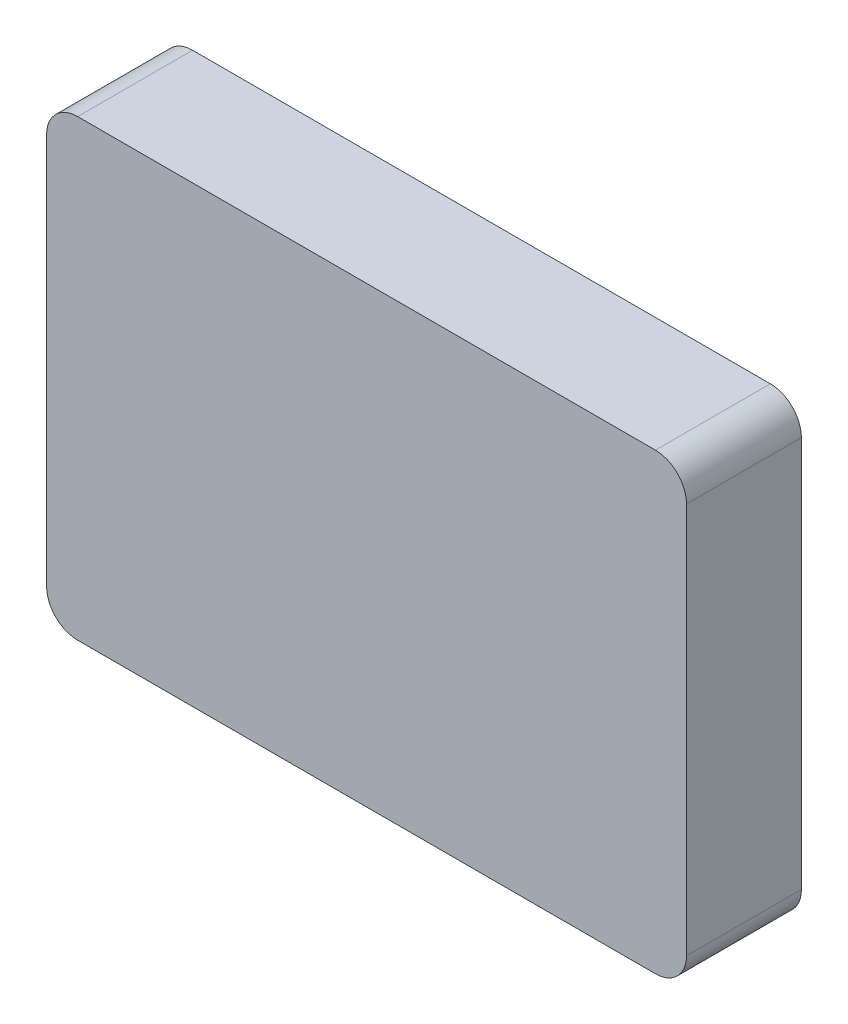
ISO-10303-21;
HEADER;
FILE_DESCRIPTION(('STEP AP214'),'2;1');
FILE_NAME('part.step','',(''),(''),'','','');
FILE_SCHEMA(('AUTOMOTIVE_DESIGN { 1 0 10303 214 1 1 1 1 }'));
ENDSEC;
DATA;
#1=APPLICATION_CONTEXT('core data for automotive mechanical design processes');
#2=APPLICATION_PROTOCOL_DEFINITION('international standard','automotive_design',2000,#1);
#3=PRODUCT_CONTEXT('',#1,'mechanical');
#4=PRODUCT('Part','Part','',(#3));
#5=PRODUCT_RELATED_PRODUCT_CATEGORY('part','',(#4));
#6=PRODUCT_DEFINITION_FORMATION('','',#4);
#7=PRODUCT_DEFINITION_CONTEXT('part definition',#1,'design');
#8=PRODUCT_DEFINITION('design','',#6,#7);
#9=PRODUCT_DEFINITION_SHAPE('','',#8);
#10=(LENGTH_UNIT() NAMED_UNIT(*) SI_UNIT(.MILLI.,.METRE.));
#11=(NAMED_UNIT(*) PLANE_ANGLE_UNIT() SI_UNIT($,.RADIAN.));
#12=(NAMED_UNIT(*) SI_UNIT($,.STERADIAN.) SOLID_ANGLE_UNIT());
#13=UNCERTAINTY_MEASURE_WITH_UNIT(LENGTH_MEASURE(1.E-05),#10,'distance_accuracy_value','');
#14=(GEOMETRIC_REPRESENTATION_CONTEXT(3) GLOBAL_UNCERTAINTY_ASSIGNED_CONTEXT((#13)) GLOBAL_UNIT_ASSIGNED_CONTEXT((#10,
#11,#12)) REPRESENTATION_CONTEXT('',''));
#15=CARTESIAN_POINT('',(0.,0.,0.));
#16=DIRECTION('',(0.,0.,1.));
#17=DIRECTION('',(1.,0.,0.));
#18=AXIS2_PLACEMENT_3D('',#15,#16,#17);
#19=CARTESIAN_POINT('',(0.,0.,-18.5));
#20=DIRECTION('',(0.,0.,-1.));
#21=DIRECTION('',(-1.,0.,0.));
#22=AXIS2_PLACEMENT_3D('',#19,#20,#21);
#23=PLANE('',#22);
#24=DIRECTION('',(1.,0.,0.));
#25=VECTOR('',#24,1.);
#26=CARTESIAN_POINT('',(-51.5,-36.5,-18.5));
#27=LINE('',#26,#25);
#28=CARTESIAN_POINT('',(-46.5,-36.5,-18.5));
#29=VERTEX_POINT('',#28);
#30=CARTESIAN_POINT('',(46.5,-36.5,-18.5));
#31=VERTEX_POINT('',#30);
#32=EDGE_CURVE('E178',#29,#31,#27,.T.);
#33=ORIENTED_EDGE('',*,*,#32,.F.);
#34=CARTESIAN_POINT('',(-46.5,-31.5,-18.5));
#35=DIRECTION('',(0.,0.,-1.));
#36=DIRECTION('',(-1.,0.,0.));
#37=AXIS2_PLACEMENT_3D('',#34,#35,#36);
#38=CIRCLE('',#37,5.);
#39=CARTESIAN_POINT('',(-51.5,-31.5,-18.5));
#40=VERTEX_POINT('',#39);
#41=EDGE_CURVE('E214',#29,#40,#38,.T.);
#42=ORIENTED_EDGE('',*,*,#41,.T.);
#43=DIRECTION('',(0.,-1.,0.));
#44=VECTOR('',#43,1.);
#45=CARTESIAN_POINT('',(-51.5,-36.5,-18.5));
#46=LINE('',#45,#44);
#47=CARTESIAN_POINT('',(-51.5,31.5,-18.5));
#48=VERTEX_POINT('',#47);
#49=EDGE_CURVE('E175',#48,#40,#46,.T.);
#50=ORIENTED_EDGE('',*,*,#49,.F.);
#51=CARTESIAN_POINT('',(-46.5,31.5,-18.5));
#52=DIRECTION('',(0.,0.,-1.));
#53=DIRECTION('',(-1.,0.,0.));
#54=AXIS2_PLACEMENT_3D('',#51,#52,#53);
#55=CIRCLE('',#54,5.);
#56=CARTESIAN_POINT('',(-46.5,36.5,-18.5));
#57=VERTEX_POINT('',#56);
#58=EDGE_CURVE('E51',#48,#57,#55,.T.);
#59=ORIENTED_EDGE('',*,*,#58,.T.);
#60=DIRECTION('',(-1.,0.,0.));
#61=VECTOR('',#60,1.);
#62=CARTESIAN_POINT('',(38.,36.5,-18.5));
#63=LINE('',#62,#61);
#64=CARTESIAN_POINT('',(46.5,36.5,-18.5));
#65=VERTEX_POINT('',#64);
#66=EDGE_CURVE('E172',#65,#57,#63,.T.);
#67=ORIENTED_EDGE('',*,*,#66,.F.);
#68=CARTESIAN_POINT('',(46.5,31.5,-18.5));
#69=DIRECTION('',(0.,0.,-1.));
#70=DIRECTION('',(-1.,0.,0.));
#71=AXIS2_PLACEMENT_3D('',#68,#69,#70);
#72=CIRCLE('',#71,5.);
#73=CARTESIAN_POINT('',(51.5,31.5,-18.5));
#74=VERTEX_POINT('',#73);
#75=EDGE_CURVE('E209',#65,#74,#72,.T.);
#76=ORIENTED_EDGE('',*,*,#75,.T.);
#77=DIRECTION('',(0.,1.,0.));
#78=VECTOR('',#77,1.);
#79=CARTESIAN_POINT('',(51.5,-36.5,-18.5));
#80=LINE('',#79,#78);
#81=CARTESIAN_POINT('',(51.5,-31.5,-18.5));
#82=VERTEX_POINT('',#81);
#83=EDGE_CURVE('E169',#82,#74,#80,.T.);
#84=ORIENTED_EDGE('',*,*,#83,.F.);
#85=CARTESIAN_POINT('',(46.5,-31.5,-18.5));
#86=DIRECTION('',(0.,0.,-1.));
#87=DIRECTION('',(-1.,0.,0.));
#88=AXIS2_PLACEMENT_3D('',#85,#86,#87);
#89=CIRCLE('',#88,5.);
#90=EDGE_CURVE('E211',#82,#31,#89,.T.);
#91=ORIENTED_EDGE('',*,*,#90,.T.);
#92=EDGE_LOOP('',(#33,#42,#50,#59,#67,#76,#84,#91));
#93=FACE_BOUND('',#92,.T.);
#94=DIRECTION('',(1.,0.,0.));
#95=VECTOR('',#94,1.);
#96=CARTESIAN_POINT('',(-51.5,-34.5,-18.5));
#97=LINE('',#96,#95);
#98=CARTESIAN_POINT('',(-49.5,-34.5,-18.5));
#99=VERTEX_POINT('',#98);
#100=CARTESIAN_POINT('',(49.5,-34.5,-18.5));
#101=VERTEX_POINT('',#100);
#102=EDGE_CURVE('E162',#99,#101,#97,.T.);
#103=ORIENTED_EDGE('',*,*,#102,.T.);
#104=DIRECTION('',(0.,1.,0.));
#105=VECTOR('',#104,1.);
#106=CARTESIAN_POINT('',(49.5,-36.5,-18.5));
#107=LINE('',#106,#105);
#108=CARTESIAN_POINT('',(49.5,34.5,-18.5));
#109=VERTEX_POINT('',#108);
#110=EDGE_CURVE('E131',#101,#109,#107,.T.);
#111=ORIENTED_EDGE('',*,*,#110,.T.);
#112=DIRECTION('',(-1.,0.,0.));
#113=VECTOR('',#112,1.);
#114=CARTESIAN_POINT('',(-5.49999999999999,34.5,-18.5));
#115=LINE('',#114,#113);
#116=CARTESIAN_POINT('',(-49.5,34.5,-18.5));
#117=VERTEX_POINT('',#116);
#118=EDGE_CURVE('E152',#109,#117,#115,.T.);
#119=ORIENTED_EDGE('',*,*,#118,.T.);
#120=DIRECTION('',(0.,-1.,0.));
#121=VECTOR('',#120,1.);
#122=CARTESIAN_POINT('',(-49.5,-36.5,-18.5));
#123=LINE('',#122,#121);
#124=EDGE_CURVE('E164',#117,#99,#123,.T.);
#125=ORIENTED_EDGE('',*,*,#124,.T.);
#126=EDGE_LOOP('',(#103,#111,#119,#125));
#127=FACE_BOUND('',#126,.T.);
#128=ADVANCED_FACE('F36',(#93,#127),#23,.T.);
#129=CARTESIAN_POINT('',(51.5,-36.5,-18.5));
#130=DIRECTION('',(1.,0.,0.));
#131=DIRECTION('',(0.,0.,-1.));
#132=AXIS2_PLACEMENT_3D('',#129,#130,#131);
#133=PLANE('',#132);
#134=DIRECTION('',(0.,1.,0.));
#135=VECTOR('',#134,1.);
#136=CARTESIAN_POINT('',(51.5,-36.5,0.));
#137=LINE('',#136,#135);
#138=CARTESIAN_POINT('',(51.5,-31.5,0.));
#139=VERTEX_POINT('',#138);
#140=CARTESIAN_POINT('',(51.5,31.5,0.));
#141=VERTEX_POINT('',#140);
#142=EDGE_CURVE('E136',#139,#141,#137,.T.);
#143=ORIENTED_EDGE('',*,*,#142,.F.);
#144=DIRECTION('',(0.,0.,1.));
#145=VECTOR('',#144,1.);
#146=CARTESIAN_POINT('',(51.5,-31.5,-18.5));
#147=LINE('',#146,#145);
#148=EDGE_CURVE('E11',#139,#82,#147,.F.);
#149=ORIENTED_EDGE('',*,*,#148,.T.);
#150=ORIENTED_EDGE('',*,*,#83,.T.);
#151=DIRECTION('',(0.,0.,1.));
#152=VECTOR('',#151,1.);
#153=CARTESIAN_POINT('',(51.5,31.5,-18.5));
#154=LINE('',#153,#152);
#155=EDGE_CURVE('E44',#74,#141,#154,.T.);
#156=ORIENTED_EDGE('',*,*,#155,.T.);
#157=EDGE_LOOP('',(#143,#149,#150,#156));
#158=FACE_BOUND('',#157,.T.);
#159=ADVANCED_FACE('F223',(#158),#133,.T.);
#160=CARTESIAN_POINT('',(-51.5,-36.5,-18.5));
#161=DIRECTION('',(0.,-1.,0.));
#162=DIRECTION('',(0.,0.,-1.));
#163=AXIS2_PLACEMENT_3D('',#160,#161,#162);
#164=PLANE('',#163);
#165=DIRECTION('',(1.,0.,0.));
#166=VECTOR('',#165,1.);
#167=CARTESIAN_POINT('',(-51.5,-36.5,0.));
#168=LINE('',#167,#166);
#169=CARTESIAN_POINT('',(-46.5,-36.5,0.));
#170=VERTEX_POINT('',#169);
#171=CARTESIAN_POINT('',(46.5,-36.5,0.));
#172=VERTEX_POINT('',#171);
#173=EDGE_CURVE('E173',#170,#172,#168,.T.);
#174=ORIENTED_EDGE('',*,*,#173,.F.);
#175=DIRECTION('',(0.,0.,1.));
#176=VECTOR('',#175,1.);
#177=CARTESIAN_POINT('',(-46.5,-36.5,-18.5));
#178=LINE('',#177,#176);
#179=EDGE_CURVE('E207',#170,#29,#178,.F.);
#180=ORIENTED_EDGE('',*,*,#179,.T.);
#181=ORIENTED_EDGE('',*,*,#32,.T.);
#182=DIRECTION('',(0.,0.,1.));
#183=VECTOR('',#182,1.);
#184=CARTESIAN_POINT('',(46.5,-36.5,-18.5));
#185=LINE('',#184,#183);
#186=EDGE_CURVE('E204',#31,#172,#185,.T.);
#187=ORIENTED_EDGE('',*,*,#186,.T.);
#188=EDGE_LOOP('',(#174,#180,#181,#187));
#189=FACE_BOUND('',#188,.T.);
#190=ADVANCED_FACE('F236',(#189),#164,.T.);
#191=CARTESIAN_POINT('',(-51.5,-36.5,-18.5));
#192=DIRECTION('',(-1.,0.,0.));
#193=DIRECTION('',(0.,0.,1.));
#194=AXIS2_PLACEMENT_3D('',#191,#192,#193);
#195=PLANE('',#194);
#196=ORIENTED_EDGE('',*,*,#49,.T.);
#197=DIRECTION('',(0.,0.,1.));
#198=VECTOR('',#197,1.);
#199=CARTESIAN_POINT('',(-51.5,-31.5,-18.5));
#200=LINE('',#199,#198);
#201=CARTESIAN_POINT('',(-51.5,-31.5,0.));
#202=VERTEX_POINT('',#201);
#203=EDGE_CURVE('E193',#40,#202,#200,.T.);
#204=ORIENTED_EDGE('',*,*,#203,.T.);
#205=DIRECTION('',(0.,-1.,0.));
#206=VECTOR('',#205,1.);
#207=CARTESIAN_POINT('',(-51.5,-36.5,0.));
#208=LINE('',#207,#206);
#209=CARTESIAN_POINT('',(-51.5,31.5,0.));
#210=VERTEX_POINT('',#209);
#211=EDGE_CURVE('E187',#210,#202,#208,.T.);
#212=ORIENTED_EDGE('',*,*,#211,.F.);
#213=DIRECTION('',(0.,0.,1.));
#214=VECTOR('',#213,1.);
#215=CARTESIAN_POINT('',(-51.5,31.5,-18.5));
#216=LINE('',#215,#214);
#217=EDGE_CURVE('E181',#210,#48,#216,.F.);
#218=ORIENTED_EDGE('',*,*,#217,.T.);
#219=EDGE_LOOP('',(#196,#204,#212,#218));
#220=FACE_BOUND('',#219,.T.);
#221=ADVANCED_FACE('F246',(#220),#195,.T.);
#222=CARTESIAN_POINT('',(-5.49999999999999,36.5,-18.5));
#223=DIRECTION('',(0.,1.,0.));
#224=DIRECTION('',(-1.,0.,0.));
#225=AXIS2_PLACEMENT_3D('',#222,#223,#224);
#226=PLANE('',#225);
#227=ORIENTED_EDGE('',*,*,#66,.T.);
#228=DIRECTION('',(0.,0.,1.));
#229=VECTOR('',#228,1.);
#230=CARTESIAN_POINT('',(-46.5,36.5,-18.5));
#231=LINE('',#230,#229);
#232=CARTESIAN_POINT('',(-46.5,36.5,0.));
#233=VERTEX_POINT('',#232);
#234=EDGE_CURVE('E217',#57,#233,#231,.T.);
#235=ORIENTED_EDGE('',*,*,#234,.T.);
#236=DIRECTION('',(-1.,0.,0.));
#237=VECTOR('',#236,1.);
#238=CARTESIAN_POINT('',(-5.49999999999999,36.5,0.));
#239=LINE('',#238,#237);
#240=CARTESIAN_POINT('',(46.5,36.5,0.));
#241=VERTEX_POINT('',#240);
#242=EDGE_CURVE('E184',#241,#233,#239,.T.);
#243=ORIENTED_EDGE('',*,*,#242,.F.);
#244=DIRECTION('',(0.,0.,1.));
#245=VECTOR('',#244,1.);
#246=CARTESIAN_POINT('',(46.5,36.5,-18.5));
#247=LINE('',#246,#245);
#248=EDGE_CURVE('E58',#241,#65,#247,.F.);
#249=ORIENTED_EDGE('',*,*,#248,.T.);
#250=EDGE_LOOP('',(#227,#235,#243,#249));
#251=FACE_BOUND('',#250,.T.);
#252=ADVANCED_FACE('F251',(#251),#226,.T.);
#253=CARTESIAN_POINT('',(0.,0.,0.));
#254=DIRECTION('',(0.,0.,-1.));
#255=DIRECTION('',(-1.,0.,0.));
#256=AXIS2_PLACEMENT_3D('',#253,#254,#255);
#257=PLANE('',#256);
#258=ORIENTED_EDGE('',*,*,#211,.T.);
#259=CARTESIAN_POINT('',(-46.5,-31.5,0.));
#260=DIRECTION('',(0.,0.,-1.));
#261=DIRECTION('',(-1.,0.,0.));
#262=AXIS2_PLACEMENT_3D('',#259,#260,#261);
#263=CIRCLE('',#262,5.);
#264=EDGE_CURVE('E202',#202,#170,#263,.F.);
#265=ORIENTED_EDGE('',*,*,#264,.T.);
#266=ORIENTED_EDGE('',*,*,#173,.T.);
#267=CARTESIAN_POINT('',(46.5,-31.5,0.));
#268=DIRECTION('',(0.,0.,-1.));
#269=DIRECTION('',(-1.,0.,0.));
#270=AXIS2_PLACEMENT_3D('',#267,#268,#269);
#271=CIRCLE('',#270,5.);
#272=EDGE_CURVE('E198',#172,#139,#271,.F.);
#273=ORIENTED_EDGE('',*,*,#272,.T.);
#274=ORIENTED_EDGE('',*,*,#142,.T.);
#275=CARTESIAN_POINT('',(46.5,31.5,0.));
#276=DIRECTION('',(0.,0.,-1.));
#277=DIRECTION('',(-1.,0.,0.));
#278=AXIS2_PLACEMENT_3D('',#275,#276,#277);
#279=CIRCLE('',#278,5.);
#280=EDGE_CURVE('E196',#141,#241,#279,.F.);
#281=ORIENTED_EDGE('',*,*,#280,.T.);
#282=ORIENTED_EDGE('',*,*,#242,.T.);
#283=CARTESIAN_POINT('',(-46.5,31.5,0.));
#284=DIRECTION('',(0.,0.,-1.));
#285=DIRECTION('',(-1.,0.,0.));
#286=AXIS2_PLACEMENT_3D('',#283,#284,#285);
#287=CIRCLE('',#286,5.);
#288=EDGE_CURVE('E200',#233,#210,#287,.F.);
#289=ORIENTED_EDGE('',*,*,#288,.T.);
#290=EDGE_LOOP('',(#258,#265,#266,#273,#274,#281,#282,#289));
#291=FACE_BOUND('',#290,.T.);
#292=ADVANCED_FACE('F229',(#291),#257,.F.);
#293=CARTESIAN_POINT('',(49.5,-36.5,-18.5));
#294=DIRECTION('',(1.,0.,0.));
#295=DIRECTION('',(0.,0.,-1.));
#296=AXIS2_PLACEMENT_3D('',#293,#294,#295);
#297=PLANE('',#296);
#298=DIRECTION('',(0.,1.,0.));
#299=VECTOR('',#298,1.);
#300=CARTESIAN_POINT('',(49.5,-36.5,-2.));
#301=LINE('',#300,#299);
#302=CARTESIAN_POINT('',(49.5,-34.5,-2.));
#303=VERTEX_POINT('',#302);
#304=CARTESIAN_POINT('',(49.5,34.5,-2.));
#305=VERTEX_POINT('',#304);
#306=EDGE_CURVE('E129',#303,#305,#301,.T.);
#307=ORIENTED_EDGE('',*,*,#306,.T.);
#308=DIRECTION('',(0.,0.,1.));
#309=VECTOR('',#308,1.);
#310=CARTESIAN_POINT('',(49.5,34.5,-18.5));
#311=LINE('',#310,#309);
#312=EDGE_CURVE('E157',#109,#305,#311,.T.);
#313=ORIENTED_EDGE('',*,*,#312,.F.);
#314=ORIENTED_EDGE('',*,*,#110,.F.);
#315=DIRECTION('',(0.,0.,1.));
#316=VECTOR('',#315,1.);
#317=CARTESIAN_POINT('',(49.5,-34.5,-18.5));
#318=LINE('',#317,#316);
#319=EDGE_CURVE('E126',#101,#303,#318,.T.);
#320=ORIENTED_EDGE('',*,*,#319,.T.);
#321=EDGE_LOOP('',(#307,#313,#314,#320));
#322=FACE_BOUND('',#321,.T.);
#323=ADVANCED_FACE('F128',(#322),#297,.F.);
#324=CARTESIAN_POINT('',(-51.5,-34.5,-18.5));
#325=DIRECTION('',(0.,-1.,0.));
#326=DIRECTION('',(0.,0.,-1.));
#327=AXIS2_PLACEMENT_3D('',#324,#325,#326);
#328=PLANE('',#327);
#329=DIRECTION('',(1.,0.,0.));
#330=VECTOR('',#329,1.);
#331=CARTESIAN_POINT('',(-51.5,-34.5,-2.));
#332=LINE('',#331,#330);
#333=CARTESIAN_POINT('',(-49.5,-34.5,-2.));
#334=VERTEX_POINT('',#333);
#335=EDGE_CURVE('E143',#334,#303,#332,.T.);
#336=ORIENTED_EDGE('',*,*,#335,.T.);
#337=ORIENTED_EDGE('',*,*,#319,.F.);
#338=ORIENTED_EDGE('',*,*,#102,.F.);
#339=DIRECTION('',(0.,0.,1.));
#340=VECTOR('',#339,1.);
#341=CARTESIAN_POINT('',(-49.5,-34.5,-18.5));
#342=LINE('',#341,#340);
#343=EDGE_CURVE('E137',#99,#334,#342,.T.);
#344=ORIENTED_EDGE('',*,*,#343,.T.);
#345=EDGE_LOOP('',(#336,#337,#338,#344));
#346=FACE_BOUND('',#345,.T.);
#347=ADVANCED_FACE('F148',(#346),#328,.F.);
#348=CARTESIAN_POINT('',(-49.5,-36.5,-18.5));
#349=DIRECTION('',(-1.,0.,0.));
#350=DIRECTION('',(0.,0.,1.));
#351=AXIS2_PLACEMENT_3D('',#348,#349,#350);
#352=PLANE('',#351);
#353=DIRECTION('',(0.,-1.,0.));
#354=VECTOR('',#353,1.);
#355=CARTESIAN_POINT('',(-49.5,-36.5,-2.));
#356=LINE('',#355,#354);
#357=CARTESIAN_POINT('',(-49.5,34.5,-2.));
#358=VERTEX_POINT('',#357);
#359=EDGE_CURVE('E150',#358,#334,#356,.T.);
#360=ORIENTED_EDGE('',*,*,#359,.T.);
#361=ORIENTED_EDGE('',*,*,#343,.F.);
#362=ORIENTED_EDGE('',*,*,#124,.F.);
#363=DIRECTION('',(0.,0.,1.));
#364=VECTOR('',#363,1.);
#365=CARTESIAN_POINT('',(-49.5,34.5,-18.5));
#366=LINE('',#365,#364);
#367=EDGE_CURVE('E158',#117,#358,#366,.T.);
#368=ORIENTED_EDGE('',*,*,#367,.T.);
#369=EDGE_LOOP('',(#360,#361,#362,#368));
#370=FACE_BOUND('',#369,.T.);
#371=ADVANCED_FACE('F312',(#370),#352,.F.);
#372=CARTESIAN_POINT('',(-5.49999999999999,34.5,-18.5));
#373=DIRECTION('',(0.,1.,0.));
#374=DIRECTION('',(-1.,0.,0.));
#375=AXIS2_PLACEMENT_3D('',#372,#373,#374);
#376=PLANE('',#375);
#377=DIRECTION('',(-1.,0.,0.));
#378=VECTOR('',#377,1.);
#379=CARTESIAN_POINT('',(-5.49999999999999,34.5,-2.));
#380=LINE('',#379,#378);
#381=EDGE_CURVE('E145',#305,#358,#380,.T.);
#382=ORIENTED_EDGE('',*,*,#381,.T.);
#383=ORIENTED_EDGE('',*,*,#367,.F.);
#384=ORIENTED_EDGE('',*,*,#118,.F.);
#385=ORIENTED_EDGE('',*,*,#312,.T.);
#386=EDGE_LOOP('',(#382,#383,#384,#385));
#387=FACE_BOUND('',#386,.T.);
#388=ADVANCED_FACE('F305',(#387),#376,.F.);
#389=CARTESIAN_POINT('',(0.,0.,-2.));
#390=DIRECTION('',(0.,0.,-1.));
#391=DIRECTION('',(-1.,0.,0.));
#392=AXIS2_PLACEMENT_3D('',#389,#390,#391);
#393=PLANE('',#392);
#394=ORIENTED_EDGE('',*,*,#306,.F.);
#395=ORIENTED_EDGE('',*,*,#335,.F.);
#396=ORIENTED_EDGE('',*,*,#359,.F.);
#397=ORIENTED_EDGE('',*,*,#381,.F.);
#398=EDGE_LOOP('',(#394,#395,#396,#397));
#399=FACE_BOUND('',#398,.T.);
#400=ADVANCED_FACE('F141',(#399),#393,.T.);
#401=CARTESIAN_POINT('',(-46.5,-31.5,-18.5));
#402=DIRECTION('',(0.,0.,1.));
#403=DIRECTION('',(1.,0.,0.));
#404=AXIS2_PLACEMENT_3D('',#401,#402,#403);
#405=CYLINDRICAL_SURFACE('',#404,5.);
#406=ORIENTED_EDGE('',*,*,#41,.F.);
#407=ORIENTED_EDGE('',*,*,#179,.F.);
#408=ORIENTED_EDGE('',*,*,#264,.F.);
#409=ORIENTED_EDGE('',*,*,#203,.F.);
#410=EDGE_LOOP('',(#406,#407,#408,#409));
#411=FACE_BOUND('',#410,.T.);
#412=ADVANCED_FACE('F243',(#411),#405,.T.);
#413=CARTESIAN_POINT('',(-46.5,31.5,-18.5));
#414=DIRECTION('',(0.,0.,1.));
#415=DIRECTION('',(1.,0.,0.));
#416=AXIS2_PLACEMENT_3D('',#413,#414,#415);
#417=CYLINDRICAL_SURFACE('',#416,5.);
#418=ORIENTED_EDGE('',*,*,#58,.F.);
#419=ORIENTED_EDGE('',*,*,#217,.F.);
#420=ORIENTED_EDGE('',*,*,#288,.F.);
#421=ORIENTED_EDGE('',*,*,#234,.F.);
#422=EDGE_LOOP('',(#418,#419,#420,#421));
#423=FACE_BOUND('',#422,.T.);
#424=ADVANCED_FACE('F250',(#423),#417,.T.);
#425=CARTESIAN_POINT('',(46.5,-31.5,-18.5));
#426=DIRECTION('',(0.,0.,1.));
#427=DIRECTION('',(1.,0.,0.));
#428=AXIS2_PLACEMENT_3D('',#425,#426,#427);
#429=CYLINDRICAL_SURFACE('',#428,5.);
#430=ORIENTED_EDGE('',*,*,#90,.F.);
#431=ORIENTED_EDGE('',*,*,#148,.F.);
#432=ORIENTED_EDGE('',*,*,#272,.F.);
#433=ORIENTED_EDGE('',*,*,#186,.F.);
#434=EDGE_LOOP('',(#430,#431,#432,#433));
#435=FACE_BOUND('',#434,.T.);
#436=ADVANCED_FACE('F234',(#435),#429,.T.);
#437=CARTESIAN_POINT('',(46.5,31.5,-18.5));
#438=DIRECTION('',(0.,0.,1.));
#439=DIRECTION('',(1.,0.,0.));
#440=AXIS2_PLACEMENT_3D('',#437,#438,#439);
#441=CYLINDRICAL_SURFACE('',#440,5.);
#442=ORIENTED_EDGE('',*,*,#75,.F.);
#443=ORIENTED_EDGE('',*,*,#248,.F.);
#444=ORIENTED_EDGE('',*,*,#280,.F.);
#445=ORIENTED_EDGE('',*,*,#155,.F.);
#446=EDGE_LOOP('',(#442,#443,#444,#445));
#447=FACE_BOUND('',#446,.T.);
#448=ADVANCED_FACE('F38',(#447),#441,.T.);
#449=CLOSED_SHELL('',(#128,#159,#190,#221,#252,#292,#323,#347,#371,#388,#400,#412,#424,#436,#448));
#450=MANIFOLD_SOLID_BREP('B2',#449);
#451=ADVANCED_BREP_SHAPE_REPRESENTATION('',(#18,#450),#14);
#452=SHAPE_DEFINITION_REPRESENTATION(#9,#451);
ENDSEC;
END-ISO-10303-21;
